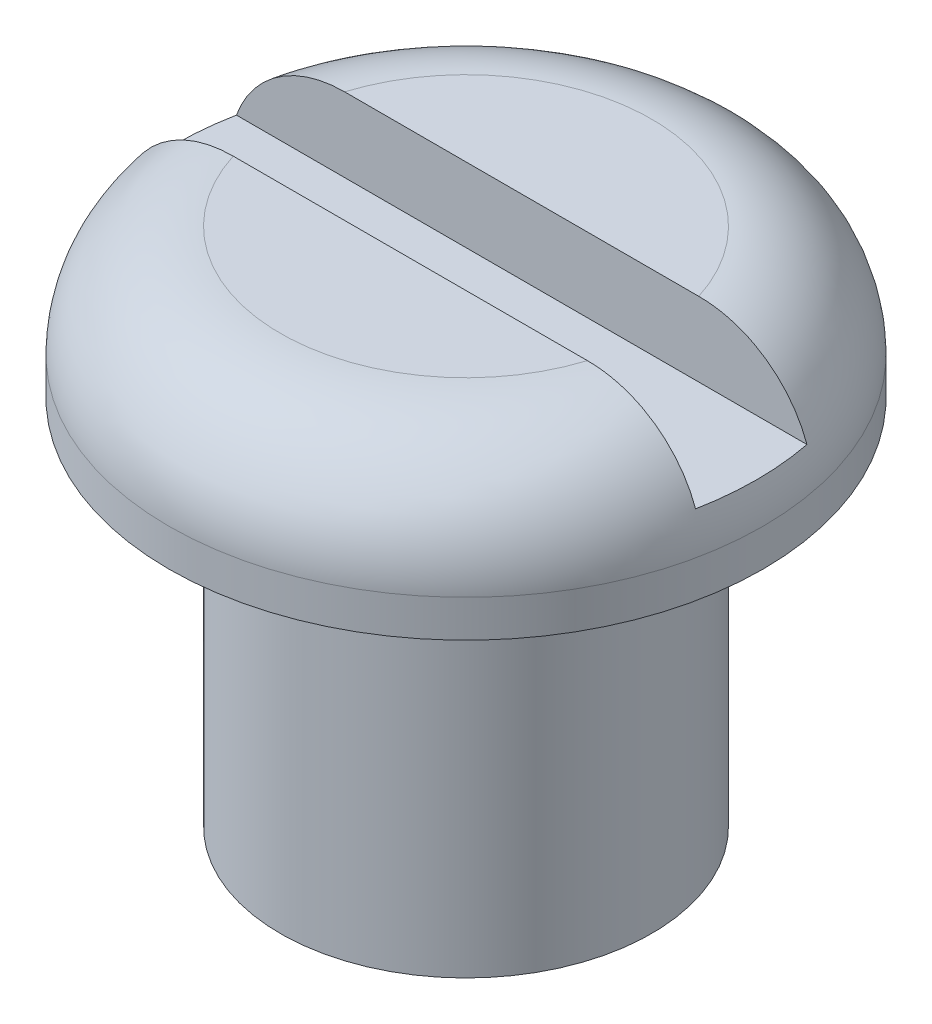
ISO-10303-21;
HEADER;
FILE_DESCRIPTION(('STEP AP214'),'2;1');
FILE_NAME('part.step','',(''),(''),'','','');
FILE_SCHEMA(('AUTOMOTIVE_DESIGN { 1 0 10303 214 1 1 1 1 }'));
ENDSEC;
DATA;
#1=APPLICATION_CONTEXT('core data for automotive mechanical design processes');
#2=APPLICATION_PROTOCOL_DEFINITION('international standard','automotive_design',2000,#1);
#3=PRODUCT_CONTEXT('',#1,'mechanical');
#4=PRODUCT('Part','Part','',(#3));
#5=PRODUCT_RELATED_PRODUCT_CATEGORY('part','',(#4));
#6=PRODUCT_DEFINITION_FORMATION('','',#4);
#7=PRODUCT_DEFINITION_CONTEXT('part definition',#1,'design');
#8=PRODUCT_DEFINITION('design','',#6,#7);
#9=PRODUCT_DEFINITION_SHAPE('','',#8);
#10=(LENGTH_UNIT() NAMED_UNIT(*) SI_UNIT(.MILLI.,.METRE.));
#11=(NAMED_UNIT(*) PLANE_ANGLE_UNIT() SI_UNIT($,.RADIAN.));
#12=(NAMED_UNIT(*) SI_UNIT($,.STERADIAN.) SOLID_ANGLE_UNIT());
#13=UNCERTAINTY_MEASURE_WITH_UNIT(LENGTH_MEASURE(1.E-05),#10,'distance_accuracy_value','');
#14=(GEOMETRIC_REPRESENTATION_CONTEXT(3) GLOBAL_UNCERTAINTY_ASSIGNED_CONTEXT((#13)) GLOBAL_UNIT_ASSIGNED_CONTEXT((#10,
#11,#12)) REPRESENTATION_CONTEXT('',''));
#15=CARTESIAN_POINT('',(0.,0.,0.));
#16=DIRECTION('',(0.,0.,1.));
#17=DIRECTION('',(1.,0.,0.));
#18=AXIS2_PLACEMENT_3D('',#15,#16,#17);
#19=CARTESIAN_POINT('',(0.,5.5,0.));
#20=DIRECTION('',(0.,1.,0.));
#21=DIRECTION('',(-1.,0.,0.));
#22=AXIS2_PLACEMENT_3D('',#19,#20,#21);
#23=TOROIDAL_SURFACE('',#22,2.5,1.5);
#24=CARTESIAN_POINT('',(0.,5.5,0.));
#25=DIRECTION('',(0.,1.,0.));
#26=DIRECTION('',(-1.,0.,0.));
#27=AXIS2_PLACEMENT_3D('',#24,#25,#26);
#28=CIRCLE('',#27,4.);
#29=CARTESIAN_POINT('',(-4.,5.5,0.));
#30=VERTEX_POINT('',#29);
#31=EDGE_CURVE('E89',#30,#30,#28,.T.);
#32=ORIENTED_EDGE('',*,*,#31,.T.);
#33=EDGE_LOOP('',(#32));
#34=FACE_BOUND('',#33,.T.);
#35=CARTESIAN_POINT('',(-3.52095850733506,6.51985651259809,-0.75));
#36=CARTESIAN_POINT('',(-3.57846349728822,6.45919390367,-0.75));
#37=CARTESIAN_POINT('',(-3.63091501875584,6.39370774136781,-0.75));
#38=CARTESIAN_POINT('',(-3.72413004031047,6.25485012983211,-0.75));
#39=CARTESIAN_POINT('',(-3.7648883308155,6.18147518593064,-0.75));
#40=CARTESIAN_POINT('',(-3.83347019571784,6.02888233352284,-0.75));
#41=CARTESIAN_POINT('',(-3.86129061229268,5.94966300400412,-0.75));
#42=CARTESIAN_POINT('',(-3.90312474222125,5.787665289345,-0.75));
#43=CARTESIAN_POINT('',(-3.91713985090397,5.70488726477155,-0.75));
#44=CARTESIAN_POINT('',(-3.93088884457454,5.53874375864449,-0.75));
#45=CARTESIAN_POINT('',(-3.93072288379791,5.45538655390416,-0.75));
#46=CARTESIAN_POINT('',(-3.91636453141221,5.28989044238381,-0.75));
#47=CARTESIAN_POINT('',(-3.902172366268,5.2077515159554,-0.75));
#48=CARTESIAN_POINT('',(-3.86023875584708,5.04720215273924,-0.75));
#49=CARTESIAN_POINT('',(-3.83252680203738,4.96878400628952,-0.75));
#50=CARTESIAN_POINT('',(-3.76440024629765,4.81767845914819,-0.75));
#51=CARTESIAN_POINT('',(-3.72398552619131,4.74499111177919,-0.75));
#52=CARTESIAN_POINT('',(-3.63139865955795,4.60695627142888,-0.75));
#53=CARTESIAN_POINT('',(-3.57916287534031,4.54165148632977,-0.75));
#54=CARTESIAN_POINT('',(-3.46460710006484,4.42059187430418,-0.75));
#55=CARTESIAN_POINT('',(-3.40228665967749,4.3648374731303,-0.75));
#56=CARTESIAN_POINT('',(-3.26842492029517,4.26357975954369,-0.75));
#57=CARTESIAN_POINT('',(-3.19676609184221,4.2182319219843,-0.75));
#58=CARTESIAN_POINT('',(-3.04700029603215,4.13988073181495,-0.75));
#59=CARTESIAN_POINT('',(-2.96889281112358,4.10687837119702,-0.75));
#60=CARTESIAN_POINT('',(-2.8063806346757,4.0532049425495,-0.75));
#61=CARTESIAN_POINT('',(-2.7218671780187,4.03286367457187,-0.75));
#62=CARTESIAN_POINT('',(-2.55067660677932,4.00607146914213,-0.75));
#63=CARTESIAN_POINT('',(-2.46399913718566,3.99962282615642,-0.75));
#64=CARTESIAN_POINT('',(-2.28721618383718,4.00042712530228,-0.75));
#65=CARTESIAN_POINT('',(-2.19711360142107,4.00824382471732,-0.75));
#66=CARTESIAN_POINT('',(-2.0192964690516,4.03800146192915,-0.75));
#67=CARTESIAN_POINT('',(-1.93158223169979,4.0599442394612,-0.75));
#68=CARTESIAN_POINT('',(-1.75529773825015,4.11865308937448,-0.75));
#69=CARTESIAN_POINT('',(-1.66700234803877,4.15624259459515,-0.75));
#70=CARTESIAN_POINT('',(-1.49726497529195,4.24464407159503,-0.75));
#71=CARTESIAN_POINT('',(-1.41582802007796,4.29546563289712,-0.75));
#72=CARTESIAN_POINT('',(-1.25525852751789,4.41328895104123,-0.75));
#73=CARTESIAN_POINT('',(-1.17684146686506,4.48126503698376,-0.75));
#74=CARTESIAN_POINT('',(-1.03194400459863,4.62903803127544,-0.75));
#75=CARTESIAN_POINT('',(-0.965464457717866,4.70883578531688,-0.75));
#76=CARTESIAN_POINT('',(-0.864439680612954,4.85473327075174,-0.75));
#77=CARTESIAN_POINT('',(-0.826189402780278,4.91827450135737,-0.75));
#78=CARTESIAN_POINT('',(-0.759647329827374,5.05035614065401,-0.75));
#79=CARTESIAN_POINT('',(-0.731332659304321,5.11888462137053,-0.75));
#80=CARTESIAN_POINT('',(-0.692391916210648,5.24541593841313,-0.75));
#81=CARTESIAN_POINT('',(-0.679313733591888,5.30264970062449,-0.75));
#82=CARTESIAN_POINT('',(-0.663120876689339,5.41847001799014,-0.75));
#83=CARTESIAN_POINT('',(-0.659988224123445,5.47705393910276,-0.75));
#84=CARTESIAN_POINT('',(-0.664154087536012,5.59385120995432,-0.75));
#85=CARTESIAN_POINT('',(-0.671455785172492,5.65206444122467,-0.75));
#86=CARTESIAN_POINT('',(-0.695396002347082,5.76658987383117,-0.75));
#87=CARTESIAN_POINT('',(-0.712055784336037,5.82289743530318,-0.75));
#88=CARTESIAN_POINT('',(-0.761701600831752,5.95623674965032,-0.75));
#89=CARTESIAN_POINT('',(-0.798626281386864,6.03178583249132,-0.75));
#90=CARTESIAN_POINT('',(-0.88375194688161,6.17624498986154,-0.75));
#91=CARTESIAN_POINT('',(-0.931980087938016,6.24513850270523,-0.75));
#92=CARTESIAN_POINT('',(-1.05165874327083,6.3934108054056,-0.75));
#93=CARTESIAN_POINT('',(-1.12586134922939,6.47057843939836,-0.75));
#94=CARTESIAN_POINT('',(-1.28592125895553,6.61154380388513,-0.75));
#95=CARTESIAN_POINT('',(-1.37177293045527,6.67534795786985,-0.75));
#96=CARTESIAN_POINT('',(-1.5532009397313,6.78761892002661,-0.75));
#97=CARTESIAN_POINT('',(-1.64879059950325,6.83606433412178,-0.75));
#98=CARTESIAN_POINT('',(-1.84706056983901,6.91525532715614,-0.75));
#99=CARTESIAN_POINT('',(-1.94973823806872,6.94600746247891,-0.75));
#100=CARTESIAN_POINT('',(-2.15384452176247,6.98691613381119,-0.75));
#101=CARTESIAN_POINT('',(-2.25508238530282,6.99801875551541,-0.75));
#102=CARTESIAN_POINT('',(-2.45790954767627,7.00149407158056,-0.75));
#103=CARTESIAN_POINT('',(-2.55949873970317,6.9938720308816,-0.75));
#104=CARTESIAN_POINT('',(-2.75145549124925,6.96095316162987,-0.75));
#105=CARTESIAN_POINT('',(-2.84207344963955,6.93710831643152,-0.75));
#106=CARTESIAN_POINT('',(-3.01757249250558,6.87366691206848,-0.75));
#107=CARTESIAN_POINT('',(-3.10245936915078,6.83408654361321,-0.75));
#108=CARTESIAN_POINT('',(-3.24531014012335,6.75089853249933,-0.75));
#109=CARTESIAN_POINT('',(-3.30501271459148,6.71024215639564,-0.75));
#110=CARTESIAN_POINT('',(-3.41804783356961,6.62087037695029,-0.75));
#111=CARTESIAN_POINT('',(-3.47138124804609,6.57215607641721,-0.75));
#112=CARTESIAN_POINT('',(-3.52095850733506,6.51985651259809,-0.75));
#113=B_SPLINE_CURVE_WITH_KNOTS('',3,(#35,#36,#37,#38,#39,#40,#41,#42,#43,#44,#45,#46,#47,#48,
#49,#50,#51,#52,#53,#54,#55,#56,#57,#58,#59,#60,#61,#62,#63,#64,#65,#66,#67,#68,#69,#70,#71,#72,
#73,#74,#75,#76,#77,#78,#79,#80,#81,#82,#83,#84,#85,#86,#87,#88,#89,#90,#91,#92,#93,#94,#95,#96,
#97,#98,#99,#100,#101,#102,#103,#104,#105,#106,#107,#108,#109,#110,#111,#112),.UNSPECIFIED.,.T.,
.F.,(4,2,2,2,2,2,2,2,2,2,2,2,2,2,2,2,2,2,2,2,2,2,2,2,2,2,2,2,2,2,2,2,2,2,2,2,2,2,4),(0.,
0.250506682292919,0.501124797914197,0.751804051300057,1.00245796545167,1.25134177602291,
1.5002215682214,1.74856087620007,1.99690249459578,2.24661425944442,2.49633715345583,
2.74957797126391,3.00283913327898,3.26244796635377,3.52209967239843,3.79223561187095,
4.0624067401042,4.34907745935924,4.63595651544455,4.94597097439421,5.25600762171397,
5.47787074696676,5.69921965783733,5.87460698137148,6.04967708064218,6.22480057394723,
6.40032358324423,6.65121238765193,6.90271023539451,7.22229893960682,7.54173367116798,
7.86161142645374,8.18137057205341,8.48526603457632,8.78907605853468,9.0687546686834,
9.34814625158153,9.56414721611142,9.7801186431436),.UNSPECIFIED.);
#114=CARTESIAN_POINT('',(-2.38484800354236,7.,-0.75));
#115=VERTEX_POINT('',#114);
#116=CARTESIAN_POINT('',(-3.84168814609743,6.,-0.75));
#117=VERTEX_POINT('',#116);
#118=EDGE_CURVE('E96',#115,#117,#113,.T.);
#119=ORIENTED_EDGE('',*,*,#118,.F.);
#120=CARTESIAN_POINT('',(0.,7.,0.));
#121=DIRECTION('',(0.,1.,0.));
#122=DIRECTION('',(-1.,0.,0.));
#123=AXIS2_PLACEMENT_3D('',#120,#121,#122);
#124=CIRCLE('',#123,2.5);
#125=CARTESIAN_POINT('',(2.38484800354236,7.,-0.75));
#126=VERTEX_POINT('',#125);
#127=EDGE_CURVE('E90',#126,#115,#124,.T.);
#128=ORIENTED_EDGE('',*,*,#127,.F.);
#129=CARTESIAN_POINT('',(0.853868565008503,6.12515509404896,-0.75));
#130=CARTESIAN_POINT('',(0.818535743352206,6.06726207314918,-0.75));
#131=CARTESIAN_POINT('',(0.786795274615649,6.00713388038939,-0.75));
#132=CARTESIAN_POINT('',(0.732578556832277,5.8828885147728,-0.75));
#133=CARTESIAN_POINT('',(0.710080838884707,5.81878098870274,-0.75));
#134=CARTESIAN_POINT('',(0.679386509015107,5.69700691795954,-0.75));
#135=CARTESIAN_POINT('',(0.669589041249926,5.63975461987317,-0.75));
#136=CARTESIAN_POINT('',(0.66007547344502,5.52444360661661,-0.75));
#137=CARTESIAN_POINT('',(0.6603479407475,5.46638588075611,-0.75));
#138=CARTESIAN_POINT('',(0.670889977093961,5.35136484789765,-0.75));
#139=CARTESIAN_POINT('',(0.681135581789356,5.29439925117668,-0.75));
#140=CARTESIAN_POINT('',(0.710206878878159,5.18265077059015,-0.75));
#141=CARTESIAN_POINT('',(0.729052005625428,5.12787313798168,-0.75));
#142=CARTESIAN_POINT('',(0.785122031733981,4.99366546859651,-0.75));
#143=CARTESIAN_POINT('',(0.826812798402264,4.91611351180729,-0.75));
#144=CARTESIAN_POINT('',(0.921718723127603,4.76845837105738,-0.75));
#145=CARTESIAN_POINT('',(0.974953987939572,4.6983685052436,-0.75));
#146=CARTESIAN_POINT('',(1.09270109263648,4.56402562870675,-0.75));
#147=CARTESIAN_POINT('',(1.15754023288216,4.50005969712105,-0.75));
#148=CARTESIAN_POINT('',(1.29554175443111,4.38195945191068,-0.75));
#149=CARTESIAN_POINT('',(1.36869956316549,4.32781977911668,-0.75));
#150=CARTESIAN_POINT('',(1.53591487159328,4.22186094550054,-0.75));
#151=CARTESIAN_POINT('',(1.6313646062729,4.17221117788912,-0.75));
#152=CARTESIAN_POINT('',(1.82962680893462,4.09060569523772,-0.75));
#153=CARTESIAN_POINT('',(1.93244119603982,4.05865461130345,-0.75));
#154=CARTESIAN_POINT('',(2.13686636658736,4.01552747713905,-0.75));
#155=CARTESIAN_POINT('',(2.23826891426264,4.00337086787668,-0.75));
#156=CARTESIAN_POINT('',(2.44158425996246,3.99785148147796,-0.75));
#157=CARTESIAN_POINT('',(2.54349673530628,4.0044780290545,-0.75));
#158=CARTESIAN_POINT('',(2.73616870277599,4.03556949173647,-0.75));
#159=CARTESIAN_POINT('',(2.8271670006068,4.05856057132044,-0.75));
#160=CARTESIAN_POINT('',(3.00361523831061,4.12039204882109,-0.75));
#161=CARTESIAN_POINT('',(3.08906705042454,4.15922706595684,-0.75));
#162=CARTESIAN_POINT('',(3.2469982117909,4.24919031297391,-0.75));
#163=CARTESIAN_POINT('',(3.31993388907414,4.29951869195639,-0.75));
#164=CARTESIAN_POINT('',(3.45594145333745,4.41209514733571,-0.75));
#165=CARTESIAN_POINT('',(3.51901543200706,4.47434068982655,-0.75));
#166=CARTESIAN_POINT('',(3.63134329698435,4.60670798546091,-0.75));
#167=CARTESIAN_POINT('',(3.68098642557187,4.67649971633582,-0.75));
#168=CARTESIAN_POINT('',(3.76758661395527,4.82355479097179,-0.75));
#169=CARTESIAN_POINT('',(3.80454516274659,4.90081725640556,-0.75));
#170=CARTESIAN_POINT('',(3.86404465084876,5.05904615761611,-0.75));
#171=CARTESIAN_POINT('',(3.88684344517712,5.13991571877361,-0.75));
#172=CARTESIAN_POINT('',(3.91840646490705,5.30434811673047,-0.75));
#173=CARTESIAN_POINT('',(3.92717154252363,5.38791078967286,-0.75));
#174=CARTESIAN_POINT('',(3.93038400434328,5.55457270580563,-0.75));
#175=CARTESIAN_POINT('',(3.92495656953685,5.63766956574474,-0.75));
#176=CARTESIAN_POINT('',(3.90021489919402,5.80176743794677,-0.75));
#177=CARTESIAN_POINT('',(3.88090093739776,5.88276849149098,-0.75));
#178=CARTESIAN_POINT('',(3.82898997372231,6.04032586274356,-0.75));
#179=CARTESIAN_POINT('',(3.79640286402,6.11688544214239,-0.75));
#180=CARTESIAN_POINT('',(3.71892327763743,6.26349739108495,-0.75));
#181=CARTESIAN_POINT('',(3.67403061357298,6.33354966151616,-0.75));
#182=CARTESIAN_POINT('',(3.5729136700982,6.46571135129529,-0.75));
#183=CARTESIAN_POINT('',(3.51661220003046,6.52776168051659,-0.75));
#184=CARTESIAN_POINT('',(3.39453632384674,6.64170474292344,-0.75));
#185=CARTESIAN_POINT('',(3.32876141525408,6.69359693697097,-0.75));
#186=CARTESIAN_POINT('',(3.18851962366097,6.78667846748086,-0.75));
#187=CARTESIAN_POINT('',(3.11393114389608,6.82768446673217,-0.75));
#188=CARTESIAN_POINT('',(2.95906886853868,6.89696412268213,-0.75));
#189=CARTESIAN_POINT('',(2.87879458160461,6.92523667745723,-0.75));
#190=CARTESIAN_POINT('',(2.71250183088778,6.96914994404352,-0.75));
#191=CARTESIAN_POINT('',(2.626386075938,6.98442153841102,-0.75));
#192=CARTESIAN_POINT('',(2.45282976687254,7.00093242726257,-0.75));
#193=CARTESIAN_POINT('',(2.36538896713134,7.00216908740359,-0.75));
#194=CARTESIAN_POINT('',(2.18757886998772,6.99073107784755,-0.75));
#195=CARTESIAN_POINT('',(2.09724935191456,6.9774438386289,-0.75));
#196=CARTESIAN_POINT('',(1.9198300294628,6.93684048827844,-0.75));
#197=CARTESIAN_POINT('',(1.83274059995812,6.90952275921754,-0.75));
#198=CARTESIAN_POINT('',(1.65817807103077,6.83982762808558,-0.75));
#199=CARTESIAN_POINT('',(1.57105161253305,6.79658296192409,-0.75));
#200=CARTESIAN_POINT('',(1.40449795104909,6.69713164378767,-0.75));
#201=CARTESIAN_POINT('',(1.32507785155064,6.64091319120372,-0.75));
#202=CARTESIAN_POINT('',(1.17258951886476,6.51464458912829,-0.75));
#203=CARTESIAN_POINT('',(1.09990054279236,6.44413251211067,-0.75));
#204=CARTESIAN_POINT('',(1.00011944880057,6.33037158938151,-0.75));
#205=CARTESIAN_POINT('',(0.968393762904263,6.29110735807001,-0.75));
#206=CARTESIAN_POINT('',(0.908406936048916,6.21002513322925,-0.75));
#207=CARTESIAN_POINT('',(0.880144393870809,6.16820818288182,-0.75));
#208=CARTESIAN_POINT('',(0.853868565008503,6.12515509404896,-0.75));
#209=B_SPLINE_CURVE_WITH_KNOTS('',3,(#129,#130,#131,#132,#133,#134,#135,#136,#137,#138,#139,
#140,#141,#142,#143,#144,#145,#146,#147,#148,#149,#150,#151,#152,#153,#154,#155,#156,#157,#158,
#159,#160,#161,#162,#163,#164,#165,#166,#167,#168,#169,#170,#171,#172,#173,#174,#175,#176,#177,
#178,#179,#180,#181,#182,#183,#184,#185,#186,#187,#188,#189,#190,#191,#192,#193,#194,#195,#196,
#197,#198,#199,#200,#201,#202,#203,#204,#205,#206,#207,#208),.UNSPECIFIED.,.T.,.F.,(4,2,2,2,2,2,
2,2,2,2,2,2,2,2,2,2,2,2,2,2,2,2,2,2,2,2,2,2,2,2,2,2,2,2,2,2,2,2,2,4),(0.,0.203357217618837,
0.406239372967952,0.579698137113111,0.752959975092002,0.92580650912021,1.09904561440609,
1.36175129340615,1.62491824845132,1.89722068110472,2.16937415279301,2.49048499026515,
2.81167981119276,3.11641780102863,3.42098262970894,3.70111207422335,3.98114646268807,
4.24567342526386,4.51014420471029,4.76583625999023,5.02149829026091,5.27235649236047,
5.52319946020389,5.77183741756632,6.02047047375213,6.26891856741351,6.51737044455611,
6.76756308868297,7.01776900806302,7.2719540706717,7.52616112565747,7.78736533651023,
8.04861857431995,8.32133111767035,8.59407511599174,8.88463766874972,9.17546555842143,
9.47788326829765,9.62917459593791,9.78040450619091),.UNSPECIFIED.);
#210=CARTESIAN_POINT('',(3.84168814609745,6.,-0.75));
#211=VERTEX_POINT('',#210);
#212=EDGE_CURVE('E143',#211,#126,#209,.T.);
#213=ORIENTED_EDGE('',*,*,#212,.F.);
#214=CARTESIAN_POINT('',(0.,6.,0.));
#215=DIRECTION('',(0.,-1.,0.));
#216=DIRECTION('',(1.,0.,0.));
#217=AXIS2_PLACEMENT_3D('',#214,#215,#216);
#218=CIRCLE('',#217,3.9142135623731);
#219=CARTESIAN_POINT('',(3.84168814609745,6.,0.75));
#220=VERTEX_POINT('',#219);
#221=EDGE_CURVE('E37',#211,#220,#218,.T.);
#222=ORIENTED_EDGE('',*,*,#221,.T.);
#223=CARTESIAN_POINT('',(0.853868565008503,6.12515509404896,0.75));
#224=CARTESIAN_POINT('',(0.818535743352206,6.06726207314918,0.75));
#225=CARTESIAN_POINT('',(0.786795274615649,6.00713388038939,0.75));
#226=CARTESIAN_POINT('',(0.732578556832277,5.8828885147728,0.75));
#227=CARTESIAN_POINT('',(0.710080838884707,5.81878098870274,0.75));
#228=CARTESIAN_POINT('',(0.679386509015107,5.69700691795954,0.75));
#229=CARTESIAN_POINT('',(0.669589041249926,5.63975461987317,0.75));
#230=CARTESIAN_POINT('',(0.66007547344502,5.52444360661661,0.75));
#231=CARTESIAN_POINT('',(0.6603479407475,5.46638588075611,0.75));
#232=CARTESIAN_POINT('',(0.670889977093961,5.35136484789765,0.75));
#233=CARTESIAN_POINT('',(0.681135581789356,5.29439925117668,0.75));
#234=CARTESIAN_POINT('',(0.710206878878159,5.18265077059015,0.75));
#235=CARTESIAN_POINT('',(0.729052005625428,5.12787313798168,0.75));
#236=CARTESIAN_POINT('',(0.785122031733981,4.99366546859651,0.75));
#237=CARTESIAN_POINT('',(0.826812798402264,4.91611351180729,0.75));
#238=CARTESIAN_POINT('',(0.921718723127603,4.76845837105738,0.75));
#239=CARTESIAN_POINT('',(0.974953987939572,4.6983685052436,0.75));
#240=CARTESIAN_POINT('',(1.09270109263648,4.56402562870675,0.75));
#241=CARTESIAN_POINT('',(1.15754023288216,4.50005969712105,0.75));
#242=CARTESIAN_POINT('',(1.29554175443111,4.38195945191068,0.75));
#243=CARTESIAN_POINT('',(1.36869956316549,4.32781977911668,0.75));
#244=CARTESIAN_POINT('',(1.53591487159328,4.22186094550054,0.75));
#245=CARTESIAN_POINT('',(1.6313646062729,4.17221117788912,0.75));
#246=CARTESIAN_POINT('',(1.82962680893462,4.09060569523772,0.75));
#247=CARTESIAN_POINT('',(1.93244119603982,4.05865461130345,0.75));
#248=CARTESIAN_POINT('',(2.13686636658736,4.01552747713905,0.75));
#249=CARTESIAN_POINT('',(2.23826891426264,4.00337086787668,0.75));
#250=CARTESIAN_POINT('',(2.44158425996246,3.99785148147796,0.75));
#251=CARTESIAN_POINT('',(2.54349673530628,4.0044780290545,0.75));
#252=CARTESIAN_POINT('',(2.73616870277599,4.03556949173647,0.75));
#253=CARTESIAN_POINT('',(2.8271670006068,4.05856057132044,0.75));
#254=CARTESIAN_POINT('',(3.00361523831061,4.12039204882109,0.75));
#255=CARTESIAN_POINT('',(3.08906705042454,4.15922706595684,0.75));
#256=CARTESIAN_POINT('',(3.2469982117909,4.24919031297391,0.75));
#257=CARTESIAN_POINT('',(3.31993388907414,4.29951869195639,0.75));
#258=CARTESIAN_POINT('',(3.45594145333745,4.41209514733571,0.75));
#259=CARTESIAN_POINT('',(3.51901543200706,4.47434068982655,0.75));
#260=CARTESIAN_POINT('',(3.63134329698435,4.60670798546091,0.75));
#261=CARTESIAN_POINT('',(3.68098642557187,4.67649971633582,0.75));
#262=CARTESIAN_POINT('',(3.76758661395527,4.82355479097179,0.75));
#263=CARTESIAN_POINT('',(3.80454516274659,4.90081725640556,0.75));
#264=CARTESIAN_POINT('',(3.86404465084876,5.05904615761611,0.75));
#265=CARTESIAN_POINT('',(3.88684344517712,5.13991571877361,0.75));
#266=CARTESIAN_POINT('',(3.91840646490705,5.30434811673047,0.75));
#267=CARTESIAN_POINT('',(3.92717154252363,5.38791078967286,0.75));
#268=CARTESIAN_POINT('',(3.93038400434328,5.55457270580563,0.75));
#269=CARTESIAN_POINT('',(3.92495656953685,5.63766956574474,0.75));
#270=CARTESIAN_POINT('',(3.90021489919402,5.80176743794677,0.75));
#271=CARTESIAN_POINT('',(3.88090093739776,5.88276849149098,0.75));
#272=CARTESIAN_POINT('',(3.82898997372231,6.04032586274356,0.75));
#273=CARTESIAN_POINT('',(3.79640286402,6.11688544214239,0.75));
#274=CARTESIAN_POINT('',(3.71892327763743,6.26349739108495,0.75));
#275=CARTESIAN_POINT('',(3.67403061357298,6.33354966151616,0.75));
#276=CARTESIAN_POINT('',(3.5729136700982,6.46571135129529,0.75));
#277=CARTESIAN_POINT('',(3.51661220003046,6.52776168051659,0.75));
#278=CARTESIAN_POINT('',(3.39453632384674,6.64170474292344,0.75));
#279=CARTESIAN_POINT('',(3.32876141525408,6.69359693697097,0.75));
#280=CARTESIAN_POINT('',(3.18851962366097,6.78667846748086,0.75));
#281=CARTESIAN_POINT('',(3.11393114389608,6.82768446673217,0.75));
#282=CARTESIAN_POINT('',(2.95906886853868,6.89696412268213,0.75));
#283=CARTESIAN_POINT('',(2.87879458160461,6.92523667745723,0.75));
#284=CARTESIAN_POINT('',(2.71250183088778,6.96914994404352,0.75));
#285=CARTESIAN_POINT('',(2.626386075938,6.98442153841102,0.75));
#286=CARTESIAN_POINT('',(2.45282976687254,7.00093242726257,0.75));
#287=CARTESIAN_POINT('',(2.36538896713134,7.00216908740359,0.75));
#288=CARTESIAN_POINT('',(2.18757886998772,6.99073107784755,0.75));
#289=CARTESIAN_POINT('',(2.09724935191456,6.9774438386289,0.75));
#290=CARTESIAN_POINT('',(1.9198300294628,6.93684048827844,0.75));
#291=CARTESIAN_POINT('',(1.83274059995812,6.90952275921754,0.75));
#292=CARTESIAN_POINT('',(1.65817807103077,6.83982762808558,0.75));
#293=CARTESIAN_POINT('',(1.57105161253305,6.79658296192409,0.75));
#294=CARTESIAN_POINT('',(1.40449795104909,6.69713164378767,0.75));
#295=CARTESIAN_POINT('',(1.32507785155064,6.64091319120372,0.75));
#296=CARTESIAN_POINT('',(1.17258951886476,6.51464458912829,0.75));
#297=CARTESIAN_POINT('',(1.09990054279236,6.44413251211067,0.75));
#298=CARTESIAN_POINT('',(1.00011944880057,6.33037158938151,0.75));
#299=CARTESIAN_POINT('',(0.968393762904263,6.29110735807001,0.75));
#300=CARTESIAN_POINT('',(0.908406936048916,6.21002513322925,0.75));
#301=CARTESIAN_POINT('',(0.880144393870809,6.16820818288182,0.75));
#302=CARTESIAN_POINT('',(0.853868565008503,6.12515509404896,0.75));
#303=B_SPLINE_CURVE_WITH_KNOTS('',3,(#223,#224,#225,#226,#227,#228,#229,#230,#231,#232,#233,
#234,#235,#236,#237,#238,#239,#240,#241,#242,#243,#244,#245,#246,#247,#248,#249,#250,#251,#252,
#253,#254,#255,#256,#257,#258,#259,#260,#261,#262,#263,#264,#265,#266,#267,#268,#269,#270,#271,
#272,#273,#274,#275,#276,#277,#278,#279,#280,#281,#282,#283,#284,#285,#286,#287,#288,#289,#290,
#291,#292,#293,#294,#295,#296,#297,#298,#299,#300,#301,#302),.UNSPECIFIED.,.T.,.F.,(4,2,2,2,2,2,
2,2,2,2,2,2,2,2,2,2,2,2,2,2,2,2,2,2,2,2,2,2,2,2,2,2,2,2,2,2,2,2,2,4),(0.,0.203357217618837,
0.406239372967952,0.579698137113111,0.752959975092002,0.92580650912021,1.09904561440609,
1.36175129340615,1.62491824845132,1.89722068110472,2.16937415279301,2.49048499026515,
2.81167981119276,3.11641780102863,3.42098262970894,3.70111207422335,3.98114646268807,
4.24567342526386,4.51014420471029,4.76583625999023,5.02149829026091,5.27235649236047,
5.52319946020389,5.77183741756632,6.02047047375213,6.26891856741351,6.51737044455611,
6.76756308868297,7.01776900806302,7.2719540706717,7.52616112565747,7.78736533651023,
8.04861857431995,8.32133111767035,8.59407511599174,8.88463766874972,9.17546555842143,
9.47788326829765,9.62917459593791,9.78040450619091),.UNSPECIFIED.);
#304=CARTESIAN_POINT('',(2.38484800354236,7.,0.75));
#305=VERTEX_POINT('',#304);
#306=EDGE_CURVE('E75',#220,#305,#303,.T.);
#307=ORIENTED_EDGE('',*,*,#306,.T.);
#308=CARTESIAN_POINT('',(-2.38484800354236,7.,0.75));
#309=VERTEX_POINT('',#308);
#310=EDGE_CURVE('E84',#309,#305,#124,.T.);
#311=ORIENTED_EDGE('',*,*,#310,.F.);
#312=CARTESIAN_POINT('',(-3.52095850733506,6.51985651259809,0.75));
#313=CARTESIAN_POINT('',(-3.57846349728822,6.45919390367,0.75));
#314=CARTESIAN_POINT('',(-3.63091501875584,6.39370774136781,0.75));
#315=CARTESIAN_POINT('',(-3.72413004031047,6.25485012983211,0.75));
#316=CARTESIAN_POINT('',(-3.7648883308155,6.18147518593064,0.75));
#317=CARTESIAN_POINT('',(-3.83347019571784,6.02888233352284,0.75));
#318=CARTESIAN_POINT('',(-3.86129061229268,5.94966300400412,0.75));
#319=CARTESIAN_POINT('',(-3.90312474222125,5.787665289345,0.75));
#320=CARTESIAN_POINT('',(-3.91713985090397,5.70488726477155,0.75));
#321=CARTESIAN_POINT('',(-3.93088884457454,5.53874375864449,0.75));
#322=CARTESIAN_POINT('',(-3.93072288379791,5.45538655390416,0.75));
#323=CARTESIAN_POINT('',(-3.91636453141221,5.28989044238381,0.75));
#324=CARTESIAN_POINT('',(-3.902172366268,5.2077515159554,0.75));
#325=CARTESIAN_POINT('',(-3.86023875584708,5.04720215273924,0.75));
#326=CARTESIAN_POINT('',(-3.83252680203738,4.96878400628952,0.75));
#327=CARTESIAN_POINT('',(-3.76440024629765,4.81767845914819,0.75));
#328=CARTESIAN_POINT('',(-3.72398552619131,4.74499111177919,0.75));
#329=CARTESIAN_POINT('',(-3.63139865955795,4.60695627142888,0.75));
#330=CARTESIAN_POINT('',(-3.57916287534031,4.54165148632977,0.75));
#331=CARTESIAN_POINT('',(-3.46460710006484,4.42059187430418,0.75));
#332=CARTESIAN_POINT('',(-3.40228665967749,4.3648374731303,0.75));
#333=CARTESIAN_POINT('',(-3.26842492029517,4.26357975954369,0.75));
#334=CARTESIAN_POINT('',(-3.19676609184221,4.2182319219843,0.75));
#335=CARTESIAN_POINT('',(-3.04700029603215,4.13988073181495,0.75));
#336=CARTESIAN_POINT('',(-2.96889281112358,4.10687837119702,0.75));
#337=CARTESIAN_POINT('',(-2.8063806346757,4.0532049425495,0.75));
#338=CARTESIAN_POINT('',(-2.7218671780187,4.03286367457187,0.75));
#339=CARTESIAN_POINT('',(-2.55067660677932,4.00607146914213,0.75));
#340=CARTESIAN_POINT('',(-2.46399913718566,3.99962282615642,0.75));
#341=CARTESIAN_POINT('',(-2.28721618383718,4.00042712530228,0.75));
#342=CARTESIAN_POINT('',(-2.19711360142107,4.00824382471732,0.75));
#343=CARTESIAN_POINT('',(-2.0192964690516,4.03800146192915,0.75));
#344=CARTESIAN_POINT('',(-1.93158223169979,4.0599442394612,0.75));
#345=CARTESIAN_POINT('',(-1.75529773825015,4.11865308937448,0.75));
#346=CARTESIAN_POINT('',(-1.66700234803877,4.15624259459515,0.75));
#347=CARTESIAN_POINT('',(-1.49726497529195,4.24464407159503,0.75));
#348=CARTESIAN_POINT('',(-1.41582802007796,4.29546563289712,0.75));
#349=CARTESIAN_POINT('',(-1.25525852751789,4.41328895104123,0.75));
#350=CARTESIAN_POINT('',(-1.17684146686506,4.48126503698376,0.75));
#351=CARTESIAN_POINT('',(-1.03194400459863,4.62903803127544,0.75));
#352=CARTESIAN_POINT('',(-0.965464457717866,4.70883578531688,0.75));
#353=CARTESIAN_POINT('',(-0.864439680612954,4.85473327075174,0.75));
#354=CARTESIAN_POINT('',(-0.826189402780278,4.91827450135737,0.75));
#355=CARTESIAN_POINT('',(-0.759647329827374,5.05035614065401,0.75));
#356=CARTESIAN_POINT('',(-0.731332659304321,5.11888462137053,0.75));
#357=CARTESIAN_POINT('',(-0.692391916210648,5.24541593841313,0.75));
#358=CARTESIAN_POINT('',(-0.679313733591888,5.30264970062449,0.75));
#359=CARTESIAN_POINT('',(-0.663120876689339,5.41847001799014,0.75));
#360=CARTESIAN_POINT('',(-0.659988224123445,5.47705393910276,0.75));
#361=CARTESIAN_POINT('',(-0.664154087536012,5.59385120995432,0.75));
#362=CARTESIAN_POINT('',(-0.671455785172492,5.65206444122467,0.75));
#363=CARTESIAN_POINT('',(-0.695396002347082,5.76658987383117,0.75));
#364=CARTESIAN_POINT('',(-0.712055784336037,5.82289743530318,0.75));
#365=CARTESIAN_POINT('',(-0.761701600831752,5.95623674965032,0.75));
#366=CARTESIAN_POINT('',(-0.798626281386864,6.03178583249132,0.75));
#367=CARTESIAN_POINT('',(-0.88375194688161,6.17624498986154,0.75));
#368=CARTESIAN_POINT('',(-0.931980087938016,6.24513850270523,0.75));
#369=CARTESIAN_POINT('',(-1.05165874327083,6.3934108054056,0.75));
#370=CARTESIAN_POINT('',(-1.12586134922939,6.47057843939836,0.75));
#371=CARTESIAN_POINT('',(-1.28592125895553,6.61154380388513,0.75));
#372=CARTESIAN_POINT('',(-1.37177293045527,6.67534795786985,0.75));
#373=CARTESIAN_POINT('',(-1.5532009397313,6.78761892002661,0.75));
#374=CARTESIAN_POINT('',(-1.64879059950325,6.83606433412178,0.75));
#375=CARTESIAN_POINT('',(-1.84706056983901,6.91525532715614,0.75));
#376=CARTESIAN_POINT('',(-1.94973823806872,6.94600746247891,0.75));
#377=CARTESIAN_POINT('',(-2.15384452176247,6.98691613381119,0.75));
#378=CARTESIAN_POINT('',(-2.25508238530282,6.99801875551541,0.75));
#379=CARTESIAN_POINT('',(-2.45790954767627,7.00149407158056,0.75));
#380=CARTESIAN_POINT('',(-2.55949873970317,6.9938720308816,0.75));
#381=CARTESIAN_POINT('',(-2.75145549124925,6.96095316162987,0.75));
#382=CARTESIAN_POINT('',(-2.84207344963955,6.93710831643152,0.75));
#383=CARTESIAN_POINT('',(-3.01757249250558,6.87366691206848,0.75));
#384=CARTESIAN_POINT('',(-3.10245936915078,6.83408654361321,0.75));
#385=CARTESIAN_POINT('',(-3.24531014012335,6.75089853249933,0.75));
#386=CARTESIAN_POINT('',(-3.30501271459148,6.71024215639564,0.75));
#387=CARTESIAN_POINT('',(-3.41804783356961,6.62087037695029,0.75));
#388=CARTESIAN_POINT('',(-3.47138124804609,6.57215607641721,0.75));
#389=CARTESIAN_POINT('',(-3.52095850733506,6.51985651259809,0.75));
#390=B_SPLINE_CURVE_WITH_KNOTS('',3,(#312,#313,#314,#315,#316,#317,#318,#319,#320,#321,#322,
#323,#324,#325,#326,#327,#328,#329,#330,#331,#332,#333,#334,#335,#336,#337,#338,#339,#340,#341,
#342,#343,#344,#345,#346,#347,#348,#349,#350,#351,#352,#353,#354,#355,#356,#357,#358,#359,#360,
#361,#362,#363,#364,#365,#366,#367,#368,#369,#370,#371,#372,#373,#374,#375,#376,#377,#378,#379,
#380,#381,#382,#383,#384,#385,#386,#387,#388,#389),.UNSPECIFIED.,.T.,.F.,(4,2,2,2,2,2,2,2,2,2,2,
2,2,2,2,2,2,2,2,2,2,2,2,2,2,2,2,2,2,2,2,2,2,2,2,2,2,2,4),(0.,0.250506682292919,
0.501124797914197,0.751804051300057,1.00245796545167,1.25134177602291,1.5002215682214,
1.74856087620007,1.99690249459578,2.24661425944442,2.49633715345583,2.74957797126391,
3.00283913327898,3.26244796635377,3.52209967239843,3.79223561187095,4.0624067401042,
4.34907745935924,4.63595651544455,4.94597097439421,5.25600762171397,5.47787074696676,
5.69921965783733,5.87460698137148,6.04967708064218,6.22480057394723,6.40032358324423,
6.65121238765193,6.90271023539451,7.22229893960682,7.54173367116798,7.86161142645374,
8.18137057205341,8.48526603457632,8.78907605853468,9.0687546686834,9.34814625158153,
9.56414721611142,9.7801186431436),.UNSPECIFIED.);
#391=CARTESIAN_POINT('',(-3.84168814609743,6.,0.75));
#392=VERTEX_POINT('',#391);
#393=EDGE_CURVE('E48',#309,#392,#390,.T.);
#394=ORIENTED_EDGE('',*,*,#393,.T.);
#395=EDGE_CURVE('E11',#392,#117,#218,.T.);
#396=ORIENTED_EDGE('',*,*,#395,.T.);
#397=EDGE_LOOP('',(#119,#128,#213,#222,#307,#311,#394,#396));
#398=FACE_BOUND('',#397,.T.);
#399=ADVANCED_FACE('F33',(#34,#398),#23,.T.);
#400=CARTESIAN_POINT('',(0.,7.,0.));
#401=DIRECTION('',(0.,-1.,0.));
#402=DIRECTION('',(1.,0.,0.));
#403=AXIS2_PLACEMENT_3D('',#400,#401,#402);
#404=PLANE('',#403);
#405=DIRECTION('',(-1.,0.,0.));
#406=VECTOR('',#405,1.);
#407=CARTESIAN_POINT('',(0.,7.,-0.75));
#408=LINE('',#407,#406);
#409=EDGE_CURVE('E56',#126,#115,#408,.T.);
#410=ORIENTED_EDGE('',*,*,#409,.F.);
#411=ORIENTED_EDGE('',*,*,#127,.T.);
#412=EDGE_LOOP('',(#410,#411));
#413=FACE_BOUND('',#412,.T.);
#414=ADVANCED_FACE('F115',(#413),#404,.F.);
#415=CARTESIAN_POINT('',(0.,0.,0.));
#416=DIRECTION('',(0.,1.,0.));
#417=DIRECTION('',(-1.,0.,0.));
#418=AXIS2_PLACEMENT_3D('',#415,#416,#417);
#419=PLANE('',#418);
#420=CARTESIAN_POINT('',(0.,0.,0.));
#421=DIRECTION('',(0.,1.,0.));
#422=DIRECTION('',(-1.,0.,0.));
#423=AXIS2_PLACEMENT_3D('',#420,#421,#422);
#424=CIRCLE('',#423,2.5);
#425=CARTESIAN_POINT('',(-2.5,0.,0.));
#426=VERTEX_POINT('',#425);
#427=EDGE_CURVE('E80',#426,#426,#424,.T.);
#428=ORIENTED_EDGE('',*,*,#427,.F.);
#429=EDGE_LOOP('',(#428));
#430=FACE_BOUND('',#429,.T.);
#431=ADVANCED_FACE('F35',(#430),#419,.F.);
#432=CARTESIAN_POINT('',(0.,7.,0.));
#433=DIRECTION('',(0.,1.,0.));
#434=DIRECTION('',(-1.,0.,0.));
#435=AXIS2_PLACEMENT_3D('',#432,#433,#434);
#436=CYLINDRICAL_SURFACE('',#435,2.5);
#437=CARTESIAN_POINT('',(0.,5.,0.));
#438=DIRECTION('',(0.,1.,0.));
#439=DIRECTION('',(-1.,0.,0.));
#440=AXIS2_PLACEMENT_3D('',#437,#438,#439);
#441=CIRCLE('',#440,2.5);
#442=CARTESIAN_POINT('',(-2.5,5.,0.));
#443=VERTEX_POINT('',#442);
#444=EDGE_CURVE('E106',#443,#443,#441,.T.);
#445=ORIENTED_EDGE('',*,*,#444,.F.);
#446=EDGE_LOOP('',(#445));
#447=FACE_BOUND('',#446,.T.);
#448=ORIENTED_EDGE('',*,*,#427,.T.);
#449=EDGE_LOOP('',(#448));
#450=FACE_BOUND('',#449,.T.);
#451=ADVANCED_FACE('F112',(#447,#450),#436,.T.);
#452=CARTESIAN_POINT('',(2.5,5.,0.));
#453=DIRECTION('',(0.,1.,0.));
#454=DIRECTION('',(-1.,0.,0.));
#455=AXIS2_PLACEMENT_3D('',#452,#453,#454);
#456=PLANE('',#455);
#457=CARTESIAN_POINT('',(0.,5.,0.));
#458=DIRECTION('',(0.,1.,0.));
#459=DIRECTION('',(-1.,0.,0.));
#460=AXIS2_PLACEMENT_3D('',#457,#458,#459);
#461=CIRCLE('',#460,4.);
#462=CARTESIAN_POINT('',(-4.,5.,0.));
#463=VERTEX_POINT('',#462);
#464=EDGE_CURVE('E93',#463,#463,#461,.T.);
#465=ORIENTED_EDGE('',*,*,#464,.F.);
#466=EDGE_LOOP('',(#465));
#467=FACE_BOUND('',#466,.T.);
#468=ORIENTED_EDGE('',*,*,#444,.T.);
#469=EDGE_LOOP('',(#468));
#470=FACE_BOUND('',#469,.T.);
#471=ADVANCED_FACE('F120',(#467,#470),#456,.F.);
#472=CARTESIAN_POINT('',(0.,7.,0.));
#473=DIRECTION('',(0.,1.,0.));
#474=DIRECTION('',(-1.,0.,0.));
#475=AXIS2_PLACEMENT_3D('',#472,#473,#474);
#476=CYLINDRICAL_SURFACE('',#475,4.);
#477=ORIENTED_EDGE('',*,*,#31,.F.);
#478=EDGE_LOOP('',(#477));
#479=FACE_BOUND('',#478,.T.);
#480=ORIENTED_EDGE('',*,*,#464,.T.);
#481=EDGE_LOOP('',(#480));
#482=FACE_BOUND('',#481,.T.);
#483=ADVANCED_FACE('F131',(#479,#482),#476,.T.);
#484=ORIENTED_EDGE('',*,*,#310,.T.);
#485=DIRECTION('',(-1.,0.,0.));
#486=VECTOR('',#485,1.);
#487=CARTESIAN_POINT('',(0.,7.,0.75));
#488=LINE('',#487,#486);
#489=EDGE_CURVE('E72',#305,#309,#488,.T.);
#490=ORIENTED_EDGE('',*,*,#489,.T.);
#491=EDGE_LOOP('',(#484,#490));
#492=FACE_BOUND('',#491,.T.);
#493=ADVANCED_FACE('F88',(#492),#404,.F.);
#494=CARTESIAN_POINT('',(4.,6.,-0.75));
#495=DIRECTION('',(0.,-1.,0.));
#496=DIRECTION('',(1.,0.,0.));
#497=AXIS2_PLACEMENT_3D('',#494,#495,#496);
#498=PLANE('',#497);
#499=DIRECTION('',(1.,0.,0.));
#500=VECTOR('',#499,1.);
#501=CARTESIAN_POINT('',(4.,6.,0.75));
#502=LINE('',#501,#500);
#503=EDGE_CURVE('E159',#392,#220,#502,.T.);
#504=ORIENTED_EDGE('',*,*,#503,.T.);
#505=ORIENTED_EDGE('',*,*,#221,.F.);
#506=DIRECTION('',(1.,0.,0.));
#507=VECTOR('',#506,1.);
#508=CARTESIAN_POINT('',(4.,6.,-0.75));
#509=LINE('',#508,#507);
#510=EDGE_CURVE('E86',#117,#211,#509,.T.);
#511=ORIENTED_EDGE('',*,*,#510,.F.);
#512=ORIENTED_EDGE('',*,*,#395,.F.);
#513=EDGE_LOOP('',(#504,#505,#511,#512));
#514=FACE_BOUND('',#513,.T.);
#515=ADVANCED_FACE('F149',(#514),#498,.F.);
#516=CARTESIAN_POINT('',(0.,0.,-0.75));
#517=DIRECTION('',(0.,0.,1.));
#518=DIRECTION('',(1.,0.,0.));
#519=AXIS2_PLACEMENT_3D('',#516,#517,#518);
#520=PLANE('',#519);
#521=ORIENTED_EDGE('',*,*,#118,.T.);
#522=ORIENTED_EDGE('',*,*,#510,.T.);
#523=ORIENTED_EDGE('',*,*,#212,.T.);
#524=ORIENTED_EDGE('',*,*,#409,.T.);
#525=EDGE_LOOP('',(#521,#522,#523,#524));
#526=FACE_BOUND('',#525,.T.);
#527=ADVANCED_FACE('F146',(#526),#520,.T.);
#528=CARTESIAN_POINT('',(0.,0.,0.75));
#529=DIRECTION('',(0.,0.,1.));
#530=DIRECTION('',(1.,0.,0.));
#531=AXIS2_PLACEMENT_3D('',#528,#529,#530);
#532=PLANE('',#531);
#533=ORIENTED_EDGE('',*,*,#489,.F.);
#534=ORIENTED_EDGE('',*,*,#306,.F.);
#535=ORIENTED_EDGE('',*,*,#503,.F.);
#536=ORIENTED_EDGE('',*,*,#393,.F.);
#537=EDGE_LOOP('',(#533,#534,#535,#536));
#538=FACE_BOUND('',#537,.T.);
#539=ADVANCED_FACE('F74',(#538),#532,.F.);
#540=CLOSED_SHELL('',(#399,#414,#431,#451,#471,#483,#493,#515,#527,#539));
#541=MANIFOLD_SOLID_BREP('B2',#540);
#542=ADVANCED_BREP_SHAPE_REPRESENTATION('',(#18,#541),#14);
#543=SHAPE_DEFINITION_REPRESENTATION(#9,#542);
ENDSEC;
END-ISO-10303-21;
